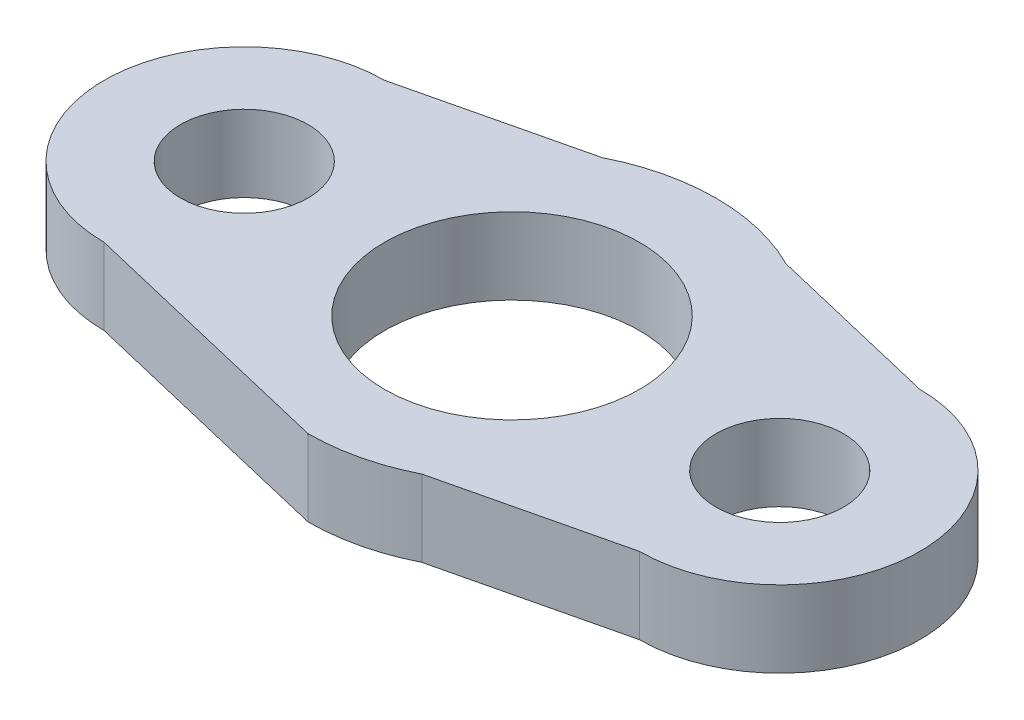
ISO-10303-21;
HEADER;
FILE_DESCRIPTION(('STEP AP214'),'2;1');
FILE_NAME('part.step','',(''),(''),'','','');
FILE_SCHEMA(('AUTOMOTIVE_DESIGN { 1 0 10303 214 1 1 1 1 }'));
ENDSEC;
DATA;
#1=APPLICATION_CONTEXT('core data for automotive mechanical design processes');
#2=APPLICATION_PROTOCOL_DEFINITION('international standard','automotive_design',2000,#1);
#3=PRODUCT_CONTEXT('',#1,'mechanical');
#4=PRODUCT('Part','Part','',(#3));
#5=PRODUCT_RELATED_PRODUCT_CATEGORY('part','',(#4));
#6=PRODUCT_DEFINITION_FORMATION('','',#4);
#7=PRODUCT_DEFINITION_CONTEXT('part definition',#1,'design');
#8=PRODUCT_DEFINITION('design','',#6,#7);
#9=PRODUCT_DEFINITION_SHAPE('','',#8);
#10=(LENGTH_UNIT() NAMED_UNIT(*) SI_UNIT(.MILLI.,.METRE.));
#11=(NAMED_UNIT(*) PLANE_ANGLE_UNIT() SI_UNIT($,.RADIAN.));
#12=(NAMED_UNIT(*) SI_UNIT($,.STERADIAN.) SOLID_ANGLE_UNIT());
#13=UNCERTAINTY_MEASURE_WITH_UNIT(LENGTH_MEASURE(1.E-05),#10,'distance_accuracy_value','');
#14=(GEOMETRIC_REPRESENTATION_CONTEXT(3) GLOBAL_UNCERTAINTY_ASSIGNED_CONTEXT((#13)) GLOBAL_UNIT_ASSIGNED_CONTEXT((#10,
#11,#12)) REPRESENTATION_CONTEXT('',''));
#15=CARTESIAN_POINT('',(0.,0.,0.));
#16=DIRECTION('',(0.,0.,1.));
#17=DIRECTION('',(1.,0.,0.));
#18=AXIS2_PLACEMENT_3D('',#15,#16,#17);
#19=CARTESIAN_POINT('',(1.80257510729614,3.,7.57081545064378));
#20=DIRECTION('',(-0.23162052730604,0.,-0.972806214685367));
#21=DIRECTION('',(-0.972806214685367,0.,0.23162052730604));
#22=AXIS2_PLACEMENT_3D('',#19,#20,#21);
#23=PLANE('',#22);
#24=DIRECTION('',(0.972806214685367,0.,-0.23162052730604));
#25=VECTOR('',#24,1.);
#26=CARTESIAN_POINT('',(1.80257510729614,0.,7.57081545064378));
#27=LINE('',#26,#25);
#28=CARTESIAN_POINT('',(3.60515021459227,0.,7.14163090128755));
#29=VERTEX_POINT('',#28);
#30=CARTESIAN_POINT('',(10.5,0.,5.5));
#31=VERTEX_POINT('',#30);
#32=EDGE_CURVE('E142',#29,#31,#27,.T.);
#33=ORIENTED_EDGE('',*,*,#32,.T.);
#34=DIRECTION('',(0.,-1.,0.));
#35=VECTOR('',#34,1.);
#36=CARTESIAN_POINT('',(10.5,3.,5.5));
#37=LINE('',#36,#35);
#38=CARTESIAN_POINT('',(10.5,3.,5.5));
#39=VERTEX_POINT('',#38);
#40=EDGE_CURVE('E11',#39,#31,#37,.T.);
#41=ORIENTED_EDGE('',*,*,#40,.F.);
#42=DIRECTION('',(0.972806214685367,0.,-0.23162052730604));
#43=VECTOR('',#42,1.);
#44=CARTESIAN_POINT('',(1.80257510729614,3.,7.57081545064378));
#45=LINE('',#44,#43);
#46=CARTESIAN_POINT('',(3.60515021459227,3.,7.14163090128755));
#47=VERTEX_POINT('',#46);
#48=EDGE_CURVE('E169',#47,#39,#45,.T.);
#49=ORIENTED_EDGE('',*,*,#48,.F.);
#50=DIRECTION('',(0.,-1.,0.));
#51=VECTOR('',#50,1.);
#52=CARTESIAN_POINT('',(3.60515021459227,3.,7.14163090128755));
#53=LINE('',#52,#51);
#54=EDGE_CURVE('E141',#47,#29,#53,.T.);
#55=ORIENTED_EDGE('',*,*,#54,.T.);
#56=EDGE_LOOP('',(#33,#41,#49,#55));
#57=FACE_BOUND('',#56,.T.);
#58=ADVANCED_FACE('F35',(#57),#23,.F.);
#59=CARTESIAN_POINT('',(10.5,3.,0.));
#60=DIRECTION('',(0.,-1.,0.));
#61=DIRECTION('',(0.,0.,-1.));
#62=AXIS2_PLACEMENT_3D('',#59,#60,#61);
#63=CYLINDRICAL_SURFACE('',#62,5.5);
#64=CARTESIAN_POINT('',(10.5,0.,0.));
#65=DIRECTION('',(0.,1.,0.));
#66=DIRECTION('',(0.,0.,1.));
#67=AXIS2_PLACEMENT_3D('',#64,#65,#66);
#68=CIRCLE('',#67,5.5);
#69=CARTESIAN_POINT('',(10.5,0.,-5.5));
#70=VERTEX_POINT('',#69);
#71=EDGE_CURVE('E145',#31,#70,#68,.T.);
#72=ORIENTED_EDGE('',*,*,#71,.T.);
#73=DIRECTION('',(0.,-1.,0.));
#74=VECTOR('',#73,1.);
#75=CARTESIAN_POINT('',(10.5,3.,-5.5));
#76=LINE('',#75,#74);
#77=CARTESIAN_POINT('',(10.5,3.,-5.5));
#78=VERTEX_POINT('',#77);
#79=EDGE_CURVE('E43',#78,#70,#76,.T.);
#80=ORIENTED_EDGE('',*,*,#79,.F.);
#81=CARTESIAN_POINT('',(10.5,3.,0.));
#82=DIRECTION('',(0.,1.,0.));
#83=DIRECTION('',(0.,0.,1.));
#84=AXIS2_PLACEMENT_3D('',#81,#82,#83);
#85=CIRCLE('',#84,5.5);
#86=EDGE_CURVE('E93',#39,#78,#85,.T.);
#87=ORIENTED_EDGE('',*,*,#86,.F.);
#88=ORIENTED_EDGE('',*,*,#40,.T.);
#89=EDGE_LOOP('',(#72,#80,#87,#88));
#90=FACE_BOUND('',#89,.T.);
#91=ADVANCED_FACE('F182',(#90),#63,.T.);
#92=CARTESIAN_POINT('',(1.80257510729614,3.,-7.57081545064378));
#93=DIRECTION('',(0.23162052730604,0.,-0.972806214685367));
#94=DIRECTION('',(-0.972806214685367,0.,-0.23162052730604));
#95=AXIS2_PLACEMENT_3D('',#92,#93,#94);
#96=PLANE('',#95);
#97=DIRECTION('',(0.972806214685367,0.,0.23162052730604));
#98=VECTOR('',#97,1.);
#99=CARTESIAN_POINT('',(1.80257510729614,0.,-7.57081545064378));
#100=LINE('',#99,#98);
#101=CARTESIAN_POINT('',(3.60515021459227,0.,-7.14163090128755));
#102=VERTEX_POINT('',#101);
#103=EDGE_CURVE('E148',#102,#70,#100,.T.);
#104=ORIENTED_EDGE('',*,*,#103,.F.);
#105=DIRECTION('',(0.,-1.,0.));
#106=VECTOR('',#105,1.);
#107=CARTESIAN_POINT('',(3.60515021459227,3.,-7.14163090128755));
#108=LINE('',#107,#106);
#109=CARTESIAN_POINT('',(3.60515021459227,3.,-7.14163090128755));
#110=VERTEX_POINT('',#109);
#111=EDGE_CURVE('E175',#110,#102,#108,.T.);
#112=ORIENTED_EDGE('',*,*,#111,.F.);
#113=DIRECTION('',(0.972806214685367,0.,0.23162052730604));
#114=VECTOR('',#113,1.);
#115=CARTESIAN_POINT('',(1.80257510729614,3.,-7.57081545064378));
#116=LINE('',#115,#114);
#117=EDGE_CURVE('E181',#110,#78,#116,.T.);
#118=ORIENTED_EDGE('',*,*,#117,.T.);
#119=ORIENTED_EDGE('',*,*,#79,.T.);
#120=EDGE_LOOP('',(#104,#112,#118,#119));
#121=FACE_BOUND('',#120,.T.);
#122=ADVANCED_FACE('F179',(#121),#96,.T.);
#123=CARTESIAN_POINT('',(0.,3.,0.));
#124=DIRECTION('',(0.,-1.,0.));
#125=DIRECTION('',(0.,0.,-1.));
#126=AXIS2_PLACEMENT_3D('',#123,#124,#125);
#127=CYLINDRICAL_SURFACE('',#126,8.);
#128=CARTESIAN_POINT('',(0.,0.,0.));
#129=DIRECTION('',(0.,1.,0.));
#130=DIRECTION('',(0.,0.,1.));
#131=AXIS2_PLACEMENT_3D('',#128,#129,#130);
#132=CIRCLE('',#131,8.);
#133=CARTESIAN_POINT('',(-3.60515021459227,0.,-7.14163090128755));
#134=VERTEX_POINT('',#133);
#135=EDGE_CURVE('E151',#102,#134,#132,.T.);
#136=ORIENTED_EDGE('',*,*,#135,.T.);
#137=DIRECTION('',(0.,-1.,0.));
#138=VECTOR('',#137,1.);
#139=CARTESIAN_POINT('',(-3.60515021459227,3.,-7.14163090128755));
#140=LINE('',#139,#138);
#141=CARTESIAN_POINT('',(-3.60515021459227,3.,-7.14163090128755));
#142=VERTEX_POINT('',#141);
#143=EDGE_CURVE('E173',#142,#134,#140,.T.);
#144=ORIENTED_EDGE('',*,*,#143,.F.);
#145=CARTESIAN_POINT('',(0.,3.,0.));
#146=DIRECTION('',(0.,1.,0.));
#147=DIRECTION('',(0.,0.,1.));
#148=AXIS2_PLACEMENT_3D('',#145,#146,#147);
#149=CIRCLE('',#148,8.);
#150=EDGE_CURVE('E127',#110,#142,#149,.T.);
#151=ORIENTED_EDGE('',*,*,#150,.F.);
#152=ORIENTED_EDGE('',*,*,#111,.T.);
#153=EDGE_LOOP('',(#136,#144,#151,#152));
#154=FACE_BOUND('',#153,.T.);
#155=ADVANCED_FACE('F192',(#154),#127,.T.);
#156=CARTESIAN_POINT('',(-1.80257510729614,3.,-7.57081545064378));
#157=DIRECTION('',(-0.23162052730604,0.,-0.972806214685367));
#158=DIRECTION('',(-0.972806214685367,0.,0.23162052730604));
#159=AXIS2_PLACEMENT_3D('',#156,#157,#158);
#160=PLANE('',#159);
#161=DIRECTION('',(0.972806214685367,0.,-0.23162052730604));
#162=VECTOR('',#161,1.);
#163=CARTESIAN_POINT('',(-1.80257510729614,0.,-7.57081545064378));
#164=LINE('',#163,#162);
#165=CARTESIAN_POINT('',(-10.5,0.,-5.5));
#166=VERTEX_POINT('',#165);
#167=EDGE_CURVE('E154',#166,#134,#164,.T.);
#168=ORIENTED_EDGE('',*,*,#167,.F.);
#169=DIRECTION('',(0.,-1.,0.));
#170=VECTOR('',#169,1.);
#171=CARTESIAN_POINT('',(-10.5,3.,-5.5));
#172=LINE('',#171,#170);
#173=CARTESIAN_POINT('',(-10.5,3.,-5.5));
#174=VERTEX_POINT('',#173);
#175=EDGE_CURVE('E115',#174,#166,#172,.T.);
#176=ORIENTED_EDGE('',*,*,#175,.F.);
#177=DIRECTION('',(0.972806214685367,0.,-0.23162052730604));
#178=VECTOR('',#177,1.);
#179=CARTESIAN_POINT('',(-1.80257510729614,3.,-7.57081545064378));
#180=LINE('',#179,#178);
#181=EDGE_CURVE('E125',#174,#142,#180,.T.);
#182=ORIENTED_EDGE('',*,*,#181,.T.);
#183=ORIENTED_EDGE('',*,*,#143,.T.);
#184=EDGE_LOOP('',(#168,#176,#182,#183));
#185=FACE_BOUND('',#184,.T.);
#186=ADVANCED_FACE('F225',(#185),#160,.T.);
#187=CARTESIAN_POINT('',(-10.5,3.,0.));
#188=DIRECTION('',(0.,-1.,0.));
#189=DIRECTION('',(0.,0.,-1.));
#190=AXIS2_PLACEMENT_3D('',#187,#188,#189);
#191=CYLINDRICAL_SURFACE('',#190,5.5);
#192=CARTESIAN_POINT('',(-10.5,0.,0.));
#193=DIRECTION('',(0.,1.,0.));
#194=DIRECTION('',(0.,0.,1.));
#195=AXIS2_PLACEMENT_3D('',#192,#193,#194);
#196=CIRCLE('',#195,5.5);
#197=CARTESIAN_POINT('',(-10.5,0.,5.5));
#198=VERTEX_POINT('',#197);
#199=EDGE_CURVE('E114',#198,#166,#196,.F.);
#200=ORIENTED_EDGE('',*,*,#199,.F.);
#201=DIRECTION('',(0.,-1.,0.));
#202=VECTOR('',#201,1.);
#203=CARTESIAN_POINT('',(-10.5,3.,5.5));
#204=LINE('',#203,#202);
#205=CARTESIAN_POINT('',(-10.5,3.,5.5));
#206=VERTEX_POINT('',#205);
#207=EDGE_CURVE('E108',#206,#198,#204,.T.);
#208=ORIENTED_EDGE('',*,*,#207,.F.);
#209=CARTESIAN_POINT('',(-10.5,3.,0.));
#210=DIRECTION('',(0.,1.,0.));
#211=DIRECTION('',(0.,0.,1.));
#212=AXIS2_PLACEMENT_3D('',#209,#210,#211);
#213=CIRCLE('',#212,5.5);
#214=EDGE_CURVE('E112',#206,#174,#213,.F.);
#215=ORIENTED_EDGE('',*,*,#214,.T.);
#216=ORIENTED_EDGE('',*,*,#175,.T.);
#217=EDGE_LOOP('',(#200,#208,#215,#216));
#218=FACE_BOUND('',#217,.T.);
#219=ADVANCED_FACE('F110',(#218),#191,.T.);
#220=CARTESIAN_POINT('',(-1.80257510729614,3.,7.57081545064378));
#221=DIRECTION('',(0.23162052730604,0.,-0.972806214685367));
#222=DIRECTION('',(-0.972806214685367,0.,-0.23162052730604));
#223=AXIS2_PLACEMENT_3D('',#220,#221,#222);
#224=PLANE('',#223);
#225=DIRECTION('',(0.972806214685367,0.,0.23162052730604));
#226=VECTOR('',#225,1.);
#227=CARTESIAN_POINT('',(-1.80257510729614,0.,7.57081545064378));
#228=LINE('',#227,#226);
#229=CARTESIAN_POINT('',(0.,0.,8.));
#230=VERTEX_POINT('',#229);
#231=EDGE_CURVE('E79',#198,#230,#228,.T.);
#232=ORIENTED_EDGE('',*,*,#231,.T.);
#233=DIRECTION('',(0.,-1.,0.));
#234=VECTOR('',#233,1.);
#235=CARTESIAN_POINT('',(0.,3.,8.));
#236=LINE('',#235,#234);
#237=CARTESIAN_POINT('',(0.,3.,8.));
#238=VERTEX_POINT('',#237);
#239=EDGE_CURVE('E116',#238,#230,#236,.T.);
#240=ORIENTED_EDGE('',*,*,#239,.F.);
#241=DIRECTION('',(0.972806214685367,0.,0.23162052730604));
#242=VECTOR('',#241,1.);
#243=CARTESIAN_POINT('',(-1.80257510729614,3.,7.57081545064378));
#244=LINE('',#243,#242);
#245=EDGE_CURVE('E118',#206,#238,#244,.T.);
#246=ORIENTED_EDGE('',*,*,#245,.F.);
#247=ORIENTED_EDGE('',*,*,#207,.T.);
#248=EDGE_LOOP('',(#232,#240,#246,#247));
#249=FACE_BOUND('',#248,.T.);
#250=ADVANCED_FACE('F119',(#249),#224,.F.);
#251=CARTESIAN_POINT('',(-10.5,3.,0.));
#252=DIRECTION('',(0.,-1.,0.));
#253=DIRECTION('',(0.,0.,-1.));
#254=AXIS2_PLACEMENT_3D('',#251,#252,#253);
#255=CYLINDRICAL_SURFACE('',#254,2.5);
#256=CARTESIAN_POINT('',(-10.5,3.,0.));
#257=DIRECTION('',(0.,1.,0.));
#258=DIRECTION('',(0.,0.,1.));
#259=AXIS2_PLACEMENT_3D('',#256,#257,#258);
#260=CIRCLE('',#259,2.5);
#261=CARTESIAN_POINT('',(-10.5,3.,2.5));
#262=VERTEX_POINT('',#261);
#263=EDGE_CURVE('E135',#262,#262,#260,.F.);
#264=ORIENTED_EDGE('',*,*,#263,.F.);
#265=EDGE_LOOP('',(#264));
#266=FACE_BOUND('',#265,.T.);
#267=CARTESIAN_POINT('',(-10.5,0.,0.));
#268=DIRECTION('',(0.,1.,0.));
#269=DIRECTION('',(0.,0.,1.));
#270=AXIS2_PLACEMENT_3D('',#267,#268,#269);
#271=CIRCLE('',#270,2.5);
#272=CARTESIAN_POINT('',(-10.5,0.,2.5));
#273=VERTEX_POINT('',#272);
#274=EDGE_CURVE('E163',#273,#273,#271,.F.);
#275=ORIENTED_EDGE('',*,*,#274,.T.);
#276=EDGE_LOOP('',(#275));
#277=FACE_BOUND('',#276,.T.);
#278=ADVANCED_FACE('F210',(#266,#277),#255,.F.);
#279=CARTESIAN_POINT('',(10.5,3.,0.));
#280=DIRECTION('',(0.,-1.,0.));
#281=DIRECTION('',(0.,0.,-1.));
#282=AXIS2_PLACEMENT_3D('',#279,#280,#281);
#283=CYLINDRICAL_SURFACE('',#282,2.5);
#284=CARTESIAN_POINT('',(10.5,3.,0.));
#285=DIRECTION('',(0.,1.,0.));
#286=DIRECTION('',(0.,0.,1.));
#287=AXIS2_PLACEMENT_3D('',#284,#285,#286);
#288=CIRCLE('',#287,2.5);
#289=CARTESIAN_POINT('',(10.5,3.,2.5));
#290=VERTEX_POINT('',#289);
#291=EDGE_CURVE('E132',#290,#290,#288,.T.);
#292=ORIENTED_EDGE('',*,*,#291,.T.);
#293=EDGE_LOOP('',(#292));
#294=FACE_BOUND('',#293,.T.);
#295=CARTESIAN_POINT('',(10.5,0.,0.));
#296=DIRECTION('',(0.,1.,0.));
#297=DIRECTION('',(0.,0.,1.));
#298=AXIS2_PLACEMENT_3D('',#295,#296,#297);
#299=CIRCLE('',#298,2.5);
#300=CARTESIAN_POINT('',(10.5,0.,2.5));
#301=VERTEX_POINT('',#300);
#302=EDGE_CURVE('E160',#301,#301,#299,.T.);
#303=ORIENTED_EDGE('',*,*,#302,.F.);
#304=EDGE_LOOP('',(#303));
#305=FACE_BOUND('',#304,.T.);
#306=ADVANCED_FACE('F202',(#294,#305),#283,.F.);
#307=CARTESIAN_POINT('',(0.,3.,0.));
#308=DIRECTION('',(0.,-1.,0.));
#309=DIRECTION('',(0.,0.,-1.));
#310=AXIS2_PLACEMENT_3D('',#307,#308,#309);
#311=CYLINDRICAL_SURFACE('',#310,8.);
#312=CARTESIAN_POINT('',(0.,0.,0.));
#313=DIRECTION('',(0.,1.,0.));
#314=DIRECTION('',(0.,0.,1.));
#315=AXIS2_PLACEMENT_3D('',#312,#313,#314);
#316=CIRCLE('',#315,8.);
#317=EDGE_CURVE('E85',#230,#29,#316,.T.);
#318=ORIENTED_EDGE('',*,*,#317,.T.);
#319=ORIENTED_EDGE('',*,*,#54,.F.);
#320=CARTESIAN_POINT('',(0.,3.,0.));
#321=DIRECTION('',(0.,1.,0.));
#322=DIRECTION('',(0.,0.,1.));
#323=AXIS2_PLACEMENT_3D('',#320,#321,#322);
#324=CIRCLE('',#323,8.);
#325=EDGE_CURVE('E51',#238,#47,#324,.T.);
#326=ORIENTED_EDGE('',*,*,#325,.F.);
#327=ORIENTED_EDGE('',*,*,#239,.T.);
#328=EDGE_LOOP('',(#318,#319,#326,#327));
#329=FACE_BOUND('',#328,.T.);
#330=ADVANCED_FACE('F199',(#329),#311,.T.);
#331=CARTESIAN_POINT('',(0.,3.,0.));
#332=DIRECTION('',(0.,-1.,0.));
#333=DIRECTION('',(0.,0.,-1.));
#334=AXIS2_PLACEMENT_3D('',#331,#332,#333);
#335=CYLINDRICAL_SURFACE('',#334,5.);
#336=CARTESIAN_POINT('',(0.,3.,0.));
#337=DIRECTION('',(0.,1.,0.));
#338=DIRECTION('',(0.,0.,1.));
#339=AXIS2_PLACEMENT_3D('',#336,#337,#338);
#340=CIRCLE('',#339,5.);
#341=CARTESIAN_POINT('',(0.,3.,5.));
#342=VERTEX_POINT('',#341);
#343=EDGE_CURVE('E138',#342,#342,#340,.T.);
#344=ORIENTED_EDGE('',*,*,#343,.T.);
#345=EDGE_LOOP('',(#344));
#346=FACE_BOUND('',#345,.T.);
#347=CARTESIAN_POINT('',(0.,0.,0.));
#348=DIRECTION('',(0.,1.,0.));
#349=DIRECTION('',(0.,0.,1.));
#350=AXIS2_PLACEMENT_3D('',#347,#348,#349);
#351=CIRCLE('',#350,5.);
#352=CARTESIAN_POINT('',(0.,0.,5.));
#353=VERTEX_POINT('',#352);
#354=EDGE_CURVE('E166',#353,#353,#351,.T.);
#355=ORIENTED_EDGE('',*,*,#354,.F.);
#356=EDGE_LOOP('',(#355));
#357=FACE_BOUND('',#356,.T.);
#358=ADVANCED_FACE('F201',(#346,#357),#335,.F.);
#359=CARTESIAN_POINT('',(0.,3.,0.));
#360=DIRECTION('',(0.,1.,0.));
#361=DIRECTION('',(0.,0.,1.));
#362=AXIS2_PLACEMENT_3D('',#359,#360,#361);
#363=PLANE('',#362);
#364=ORIENTED_EDGE('',*,*,#48,.T.);
#365=ORIENTED_EDGE('',*,*,#86,.T.);
#366=ORIENTED_EDGE('',*,*,#117,.F.);
#367=ORIENTED_EDGE('',*,*,#150,.T.);
#368=ORIENTED_EDGE('',*,*,#181,.F.);
#369=ORIENTED_EDGE('',*,*,#214,.F.);
#370=ORIENTED_EDGE('',*,*,#245,.T.);
#371=ORIENTED_EDGE('',*,*,#325,.T.);
#372=EDGE_LOOP('',(#364,#365,#366,#367,#368,#369,#370,#371));
#373=FACE_BOUND('',#372,.T.);
#374=ORIENTED_EDGE('',*,*,#291,.F.);
#375=EDGE_LOOP('',(#374));
#376=FACE_BOUND('',#375,.T.);
#377=ORIENTED_EDGE('',*,*,#263,.T.);
#378=EDGE_LOOP('',(#377));
#379=FACE_BOUND('',#378,.T.);
#380=ORIENTED_EDGE('',*,*,#343,.F.);
#381=EDGE_LOOP('',(#380));
#382=FACE_BOUND('',#381,.T.);
#383=ADVANCED_FACE('F122',(#373,#376,#379,#382),#363,.T.);
#384=CARTESIAN_POINT('',(0.,0.,0.));
#385=DIRECTION('',(0.,1.,0.));
#386=DIRECTION('',(0.,0.,1.));
#387=AXIS2_PLACEMENT_3D('',#384,#385,#386);
#388=PLANE('',#387);
#389=ORIENTED_EDGE('',*,*,#32,.F.);
#390=ORIENTED_EDGE('',*,*,#317,.F.);
#391=ORIENTED_EDGE('',*,*,#231,.F.);
#392=ORIENTED_EDGE('',*,*,#199,.T.);
#393=ORIENTED_EDGE('',*,*,#167,.T.);
#394=ORIENTED_EDGE('',*,*,#135,.F.);
#395=ORIENTED_EDGE('',*,*,#103,.T.);
#396=ORIENTED_EDGE('',*,*,#71,.F.);
#397=EDGE_LOOP('',(#389,#390,#391,#392,#393,#394,#395,#396));
#398=FACE_BOUND('',#397,.T.);
#399=ORIENTED_EDGE('',*,*,#302,.T.);
#400=EDGE_LOOP('',(#399));
#401=FACE_BOUND('',#400,.T.);
#402=ORIENTED_EDGE('',*,*,#274,.F.);
#403=EDGE_LOOP('',(#402));
#404=FACE_BOUND('',#403,.T.);
#405=ORIENTED_EDGE('',*,*,#354,.T.);
#406=EDGE_LOOP('',(#405));
#407=FACE_BOUND('',#406,.T.);
#408=ADVANCED_FACE('F187',(#398,#401,#404,#407),#388,.F.);
#409=CLOSED_SHELL('',(#58,#91,#122,#155,#186,#219,#250,#278,#306,#330,#358,#383,#408));
#410=MANIFOLD_SOLID_BREP('B2',#409);
#411=ADVANCED_BREP_SHAPE_REPRESENTATION('',(#18,#410),#14);
#412=SHAPE_DEFINITION_REPRESENTATION(#9,#411);
ENDSEC;
END-ISO-10303-21;
